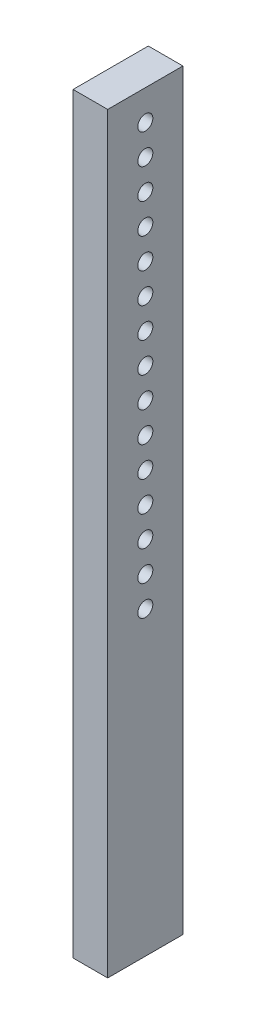
ISO-10303-21;
HEADER;
FILE_DESCRIPTION(('STEP AP214'),'2;1');
FILE_NAME('part.step','',(''),(''),'','','');
FILE_SCHEMA(('AUTOMOTIVE_DESIGN { 1 0 10303 214 1 1 1 1 }'));
ENDSEC;
DATA;
#1=APPLICATION_CONTEXT('core data for automotive mechanical design processes');
#2=APPLICATION_PROTOCOL_DEFINITION('international standard','automotive_design',2000,#1);
#3=PRODUCT_CONTEXT('',#1,'mechanical');
#4=PRODUCT('Part','Part','',(#3));
#5=PRODUCT_RELATED_PRODUCT_CATEGORY('part','',(#4));
#6=PRODUCT_DEFINITION_FORMATION('','',#4);
#7=PRODUCT_DEFINITION_CONTEXT('part definition',#1,'design');
#8=PRODUCT_DEFINITION('design','',#6,#7);
#9=PRODUCT_DEFINITION_SHAPE('','',#8);
#10=(LENGTH_UNIT() NAMED_UNIT(*) SI_UNIT(.MILLI.,.METRE.));
#11=(NAMED_UNIT(*) PLANE_ANGLE_UNIT() SI_UNIT($,.RADIAN.));
#12=(NAMED_UNIT(*) SI_UNIT($,.STERADIAN.) SOLID_ANGLE_UNIT());
#13=UNCERTAINTY_MEASURE_WITH_UNIT(LENGTH_MEASURE(1.E-05),#10,'distance_accuracy_value','');
#14=(GEOMETRIC_REPRESENTATION_CONTEXT(3) GLOBAL_UNCERTAINTY_ASSIGNED_CONTEXT((#13)) GLOBAL_UNIT_ASSIGNED_CONTEXT((#10,
#11,#12)) REPRESENTATION_CONTEXT('',''));
#15=CARTESIAN_POINT('',(0.,0.,0.));
#16=DIRECTION('',(0.,0.,1.));
#17=DIRECTION('',(1.,0.,0.));
#18=AXIS2_PLACEMENT_3D('',#15,#16,#17);
#19=CARTESIAN_POINT('',(23.,0.,0.));
#20=DIRECTION('',(1.,0.,0.));
#21=DIRECTION('',(0.,0.,-1.));
#22=AXIS2_PLACEMENT_3D('',#19,#20,#21);
#23=PLANE('',#22);
#24=CARTESIAN_POINT('',(23.,-30.,-3.42307350556765E-12));
#25=DIRECTION('',(1.,0.,0.));
#26=DIRECTION('',(0.,0.,-1.));
#27=AXIS2_PLACEMENT_3D('',#24,#25,#26);
#28=CIRCLE('',#27,5.);
#29=CARTESIAN_POINT('',(23.,-30.,-5.00000000000342));
#30=VERTEX_POINT('',#29);
#31=EDGE_CURVE('E186',#30,#30,#28,.T.);
#32=ORIENTED_EDGE('',*,*,#31,.F.);
#33=EDGE_LOOP('',(#32));
#34=FACE_BOUND('',#33,.T.);
#35=CARTESIAN_POINT('',(23.,9.99999999999998,-2.89751433454246E-12));
#36=DIRECTION('',(1.,0.,0.));
#37=DIRECTION('',(0.,0.,-1.));
#38=AXIS2_PLACEMENT_3D('',#35,#36,#37);
#39=CIRCLE('',#38,5.);
#40=CARTESIAN_POINT('',(23.,9.99999999999998,-5.0000000000029));
#41=VERTEX_POINT('',#40);
#42=EDGE_CURVE('E174',#41,#41,#39,.T.);
#43=ORIENTED_EDGE('',*,*,#42,.F.);
#44=EDGE_LOOP('',(#43));
#45=FACE_BOUND('',#44,.T.);
#46=CARTESIAN_POINT('',(23.,50.,-2.37195516351727E-12));
#47=DIRECTION('',(1.,0.,0.));
#48=DIRECTION('',(0.,0.,-1.));
#49=AXIS2_PLACEMENT_3D('',#46,#47,#48);
#50=CIRCLE('',#49,5.);
#51=CARTESIAN_POINT('',(23.,50.,-5.00000000000237));
#52=VERTEX_POINT('',#51);
#53=EDGE_CURVE('E162',#52,#52,#50,.T.);
#54=ORIENTED_EDGE('',*,*,#53,.F.);
#55=EDGE_LOOP('',(#54));
#56=FACE_BOUND('',#55,.T.);
#57=CARTESIAN_POINT('',(23.,90.,-1.84639599249208E-12));
#58=DIRECTION('',(1.,0.,0.));
#59=DIRECTION('',(0.,0.,-1.));
#60=AXIS2_PLACEMENT_3D('',#57,#58,#59);
#61=CIRCLE('',#60,5.);
#62=CARTESIAN_POINT('',(23.,90.,-5.00000000000185));
#63=VERTEX_POINT('',#62);
#64=EDGE_CURVE('E150',#63,#63,#61,.T.);
#65=ORIENTED_EDGE('',*,*,#64,.F.);
#66=EDGE_LOOP('',(#65));
#67=FACE_BOUND('',#66,.T.);
#68=CARTESIAN_POINT('',(23.,130.,-1.32083682146688E-12));
#69=DIRECTION('',(1.,0.,0.));
#70=DIRECTION('',(0.,0.,-1.));
#71=AXIS2_PLACEMENT_3D('',#68,#69,#70);
#72=CIRCLE('',#71,5.);
#73=CARTESIAN_POINT('',(23.,130.,-5.00000000000132));
#74=VERTEX_POINT('',#73);
#75=EDGE_CURVE('E138',#74,#74,#72,.T.);
#76=ORIENTED_EDGE('',*,*,#75,.F.);
#77=EDGE_LOOP('',(#76));
#78=FACE_BOUND('',#77,.T.);
#79=CARTESIAN_POINT('',(23.,170.,-7.95277650441694E-13));
#80=DIRECTION('',(1.,0.,0.));
#81=DIRECTION('',(0.,0.,-1.));
#82=AXIS2_PLACEMENT_3D('',#79,#80,#81);
#83=CIRCLE('',#82,5.);
#84=CARTESIAN_POINT('',(23.,170.,-5.0000000000008));
#85=VERTEX_POINT('',#84);
#86=EDGE_CURVE('E126',#85,#85,#83,.T.);
#87=ORIENTED_EDGE('',*,*,#86,.F.);
#88=EDGE_LOOP('',(#87));
#89=FACE_BOUND('',#88,.T.);
#90=CARTESIAN_POINT('',(23.,210.,-2.69718479416503E-13));
#91=DIRECTION('',(1.,0.,0.));
#92=DIRECTION('',(0.,0.,-1.));
#93=AXIS2_PLACEMENT_3D('',#90,#91,#92);
#94=CIRCLE('',#93,5.);
#95=CARTESIAN_POINT('',(23.,210.,-5.00000000000027));
#96=VERTEX_POINT('',#95);
#97=EDGE_CURVE('E114',#96,#96,#94,.T.);
#98=ORIENTED_EDGE('',*,*,#97,.F.);
#99=EDGE_LOOP('',(#98));
#100=FACE_BOUND('',#99,.T.);
#101=DIRECTION('',(0.,1.,0.));
#102=VECTOR('',#101,1.);
#103=CARTESIAN_POINT('',(23.,250.,-25.));
#104=LINE('',#103,#102);
#105=CARTESIAN_POINT('',(23.,-250.,-25.));
#106=VERTEX_POINT('',#105);
#107=CARTESIAN_POINT('',(23.,250.,-25.));
#108=VERTEX_POINT('',#107);
#109=EDGE_CURVE('E84',#106,#108,#104,.T.);
#110=ORIENTED_EDGE('',*,*,#109,.T.);
#111=DIRECTION('',(0.,0.,1.));
#112=VECTOR('',#111,1.);
#113=CARTESIAN_POINT('',(23.,250.,25.));
#114=LINE('',#113,#112);
#115=CARTESIAN_POINT('',(23.,250.,25.));
#116=VERTEX_POINT('',#115);
#117=EDGE_CURVE('E79',#108,#116,#114,.T.);
#118=ORIENTED_EDGE('',*,*,#117,.T.);
#119=DIRECTION('',(0.,-1.,0.));
#120=VECTOR('',#119,1.);
#121=CARTESIAN_POINT('',(23.,250.,25.));
#122=LINE('',#121,#120);
#123=CARTESIAN_POINT('',(23.,-250.,25.));
#124=VERTEX_POINT('',#123);
#125=EDGE_CURVE('E82',#116,#124,#122,.T.);
#126=ORIENTED_EDGE('',*,*,#125,.T.);
#127=DIRECTION('',(0.,0.,-1.));
#128=VECTOR('',#127,1.);
#129=CARTESIAN_POINT('',(23.,-250.,25.));
#130=LINE('',#129,#128);
#131=EDGE_CURVE('E49',#124,#106,#130,.T.);
#132=ORIENTED_EDGE('',*,*,#131,.T.);
#133=EDGE_LOOP('',(#110,#118,#126,#132));
#134=FACE_BOUND('',#133,.T.);
#135=CARTESIAN_POINT('',(23.,230.,0.));
#136=DIRECTION('',(1.,0.,0.));
#137=DIRECTION('',(0.,0.,-1.));
#138=AXIS2_PLACEMENT_3D('',#135,#136,#137);
#139=CIRCLE('',#138,5.);
#140=CARTESIAN_POINT('',(23.,230.,-5.00000000000001));
#141=VERTEX_POINT('',#140);
#142=EDGE_CURVE('E99',#141,#141,#139,.T.);
#143=ORIENTED_EDGE('',*,*,#142,.F.);
#144=EDGE_LOOP('',(#143));
#145=FACE_BOUND('',#144,.T.);
#146=CARTESIAN_POINT('',(23.,190.,-5.32498064929098E-13));
#147=DIRECTION('',(1.,0.,0.));
#148=DIRECTION('',(0.,0.,-1.));
#149=AXIS2_PLACEMENT_3D('',#146,#147,#148);
#150=CIRCLE('',#149,5.);
#151=CARTESIAN_POINT('',(23.,190.,-5.00000000000053));
#152=VERTEX_POINT('',#151);
#153=EDGE_CURVE('E120',#152,#152,#150,.T.);
#154=ORIENTED_EDGE('',*,*,#153,.F.);
#155=EDGE_LOOP('',(#154));
#156=FACE_BOUND('',#155,.T.);
#157=CARTESIAN_POINT('',(23.,150.,-1.05805723595429E-12));
#158=DIRECTION('',(1.,0.,0.));
#159=DIRECTION('',(0.,0.,-1.));
#160=AXIS2_PLACEMENT_3D('',#157,#158,#159);
#161=CIRCLE('',#160,5.);
#162=CARTESIAN_POINT('',(23.,150.,-5.00000000000106));
#163=VERTEX_POINT('',#162);
#164=EDGE_CURVE('E132',#163,#163,#161,.T.);
#165=ORIENTED_EDGE('',*,*,#164,.F.);
#166=EDGE_LOOP('',(#165));
#167=FACE_BOUND('',#166,.T.);
#168=CARTESIAN_POINT('',(23.,110.,-1.58361640697948E-12));
#169=DIRECTION('',(1.,0.,0.));
#170=DIRECTION('',(0.,0.,-1.));
#171=AXIS2_PLACEMENT_3D('',#168,#169,#170);
#172=CIRCLE('',#171,5.);
#173=CARTESIAN_POINT('',(23.,110.,-5.00000000000159));
#174=VERTEX_POINT('',#173);
#175=EDGE_CURVE('E144',#174,#174,#172,.T.);
#176=ORIENTED_EDGE('',*,*,#175,.F.);
#177=EDGE_LOOP('',(#176));
#178=FACE_BOUND('',#177,.T.);
#179=CARTESIAN_POINT('',(23.,70.,-2.10917557800467E-12));
#180=DIRECTION('',(1.,0.,0.));
#181=DIRECTION('',(0.,0.,-1.));
#182=AXIS2_PLACEMENT_3D('',#179,#180,#181);
#183=CIRCLE('',#182,5.);
#184=CARTESIAN_POINT('',(23.,70.,-5.00000000000211));
#185=VERTEX_POINT('',#184);
#186=EDGE_CURVE('E156',#185,#185,#183,.T.);
#187=ORIENTED_EDGE('',*,*,#186,.F.);
#188=EDGE_LOOP('',(#187));
#189=FACE_BOUND('',#188,.T.);
#190=CARTESIAN_POINT('',(23.,30.,-2.63473474902986E-12));
#191=DIRECTION('',(1.,0.,0.));
#192=DIRECTION('',(0.,0.,-1.));
#193=AXIS2_PLACEMENT_3D('',#190,#191,#192);
#194=CIRCLE('',#193,5.);
#195=CARTESIAN_POINT('',(23.,30.,-5.00000000000264));
#196=VERTEX_POINT('',#195);
#197=EDGE_CURVE('E168',#196,#196,#194,.T.);
#198=ORIENTED_EDGE('',*,*,#197,.F.);
#199=EDGE_LOOP('',(#198));
#200=FACE_BOUND('',#199,.T.);
#201=CARTESIAN_POINT('',(23.,-10.,-3.16029392005505E-12));
#202=DIRECTION('',(1.,0.,0.));
#203=DIRECTION('',(0.,0.,-1.));
#204=AXIS2_PLACEMENT_3D('',#201,#202,#203);
#205=CIRCLE('',#204,5.);
#206=CARTESIAN_POINT('',(23.,-10.,-5.00000000000316));
#207=VERTEX_POINT('',#206);
#208=EDGE_CURVE('E180',#207,#207,#205,.T.);
#209=ORIENTED_EDGE('',*,*,#208,.F.);
#210=EDGE_LOOP('',(#209));
#211=FACE_BOUND('',#210,.T.);
#212=CARTESIAN_POINT('',(23.,-50.,-3.68585309108025E-12));
#213=DIRECTION('',(1.,0.,0.));
#214=DIRECTION('',(0.,0.,-1.));
#215=AXIS2_PLACEMENT_3D('',#212,#213,#214);
#216=CIRCLE('',#215,5.);
#217=CARTESIAN_POINT('',(23.,-50.,-5.00000000000369));
#218=VERTEX_POINT('',#217);
#219=EDGE_CURVE('E192',#218,#218,#216,.T.);
#220=ORIENTED_EDGE('',*,*,#219,.F.);
#221=EDGE_LOOP('',(#220));
#222=FACE_BOUND('',#221,.T.);
#223=ADVANCED_FACE('F32',(#34,#45,#56,#67,#78,#89,#100,#134,#145,#156,#167,#178,#189,#200,#211,
#222),#23,.T.);
#224=CARTESIAN_POINT('',(0.,0.,0.));
#225=DIRECTION('',(1.,0.,0.));
#226=DIRECTION('',(0.,0.,-1.));
#227=AXIS2_PLACEMENT_3D('',#224,#225,#226);
#228=PLANE('',#227);
#229=CARTESIAN_POINT('',(0.,-30.,-3.42307350556765E-12));
#230=DIRECTION('',(1.,0.,0.));
#231=DIRECTION('',(0.,0.,-1.));
#232=AXIS2_PLACEMENT_3D('',#229,#230,#231);
#233=CIRCLE('',#232,5.);
#234=CARTESIAN_POINT('',(0.,-30.,-5.00000000000342));
#235=VERTEX_POINT('',#234);
#236=EDGE_CURVE('E189',#235,#235,#233,.T.);
#237=ORIENTED_EDGE('',*,*,#236,.T.);
#238=EDGE_LOOP('',(#237));
#239=FACE_BOUND('',#238,.T.);
#240=CARTESIAN_POINT('',(0.,9.99999999999998,-2.89751433454246E-12));
#241=DIRECTION('',(1.,0.,0.));
#242=DIRECTION('',(0.,0.,-1.));
#243=AXIS2_PLACEMENT_3D('',#240,#241,#242);
#244=CIRCLE('',#243,5.);
#245=CARTESIAN_POINT('',(0.,9.99999999999998,-5.0000000000029));
#246=VERTEX_POINT('',#245);
#247=EDGE_CURVE('E177',#246,#246,#244,.T.);
#248=ORIENTED_EDGE('',*,*,#247,.T.);
#249=EDGE_LOOP('',(#248));
#250=FACE_BOUND('',#249,.T.);
#251=CARTESIAN_POINT('',(0.,50.,-2.37195516351727E-12));
#252=DIRECTION('',(1.,0.,0.));
#253=DIRECTION('',(0.,0.,-1.));
#254=AXIS2_PLACEMENT_3D('',#251,#252,#253);
#255=CIRCLE('',#254,5.);
#256=CARTESIAN_POINT('',(0.,50.,-5.00000000000237));
#257=VERTEX_POINT('',#256);
#258=EDGE_CURVE('E165',#257,#257,#255,.T.);
#259=ORIENTED_EDGE('',*,*,#258,.T.);
#260=EDGE_LOOP('',(#259));
#261=FACE_BOUND('',#260,.T.);
#262=CARTESIAN_POINT('',(0.,90.,-1.84639599249208E-12));
#263=DIRECTION('',(1.,0.,0.));
#264=DIRECTION('',(0.,0.,-1.));
#265=AXIS2_PLACEMENT_3D('',#262,#263,#264);
#266=CIRCLE('',#265,5.);
#267=CARTESIAN_POINT('',(0.,90.,-5.00000000000185));
#268=VERTEX_POINT('',#267);
#269=EDGE_CURVE('E153',#268,#268,#266,.T.);
#270=ORIENTED_EDGE('',*,*,#269,.T.);
#271=EDGE_LOOP('',(#270));
#272=FACE_BOUND('',#271,.T.);
#273=CARTESIAN_POINT('',(0.,130.,-1.32083682146688E-12));
#274=DIRECTION('',(1.,0.,0.));
#275=DIRECTION('',(0.,0.,-1.));
#276=AXIS2_PLACEMENT_3D('',#273,#274,#275);
#277=CIRCLE('',#276,5.);
#278=CARTESIAN_POINT('',(0.,130.,-5.00000000000132));
#279=VERTEX_POINT('',#278);
#280=EDGE_CURVE('E141',#279,#279,#277,.T.);
#281=ORIENTED_EDGE('',*,*,#280,.T.);
#282=EDGE_LOOP('',(#281));
#283=FACE_BOUND('',#282,.T.);
#284=CARTESIAN_POINT('',(0.,170.,-7.95277650441694E-13));
#285=DIRECTION('',(1.,0.,0.));
#286=DIRECTION('',(0.,0.,-1.));
#287=AXIS2_PLACEMENT_3D('',#284,#285,#286);
#288=CIRCLE('',#287,5.);
#289=CARTESIAN_POINT('',(0.,170.,-5.0000000000008));
#290=VERTEX_POINT('',#289);
#291=EDGE_CURVE('E129',#290,#290,#288,.T.);
#292=ORIENTED_EDGE('',*,*,#291,.T.);
#293=EDGE_LOOP('',(#292));
#294=FACE_BOUND('',#293,.T.);
#295=CARTESIAN_POINT('',(0.,210.,-2.69718479416503E-13));
#296=DIRECTION('',(1.,0.,0.));
#297=DIRECTION('',(0.,0.,-1.));
#298=AXIS2_PLACEMENT_3D('',#295,#296,#297);
#299=CIRCLE('',#298,5.);
#300=CARTESIAN_POINT('',(0.,210.,-5.00000000000027));
#301=VERTEX_POINT('',#300);
#302=EDGE_CURVE('E117',#301,#301,#299,.T.);
#303=ORIENTED_EDGE('',*,*,#302,.T.);
#304=EDGE_LOOP('',(#303));
#305=FACE_BOUND('',#304,.T.);
#306=DIRECTION('',(0.,1.,0.));
#307=VECTOR('',#306,1.);
#308=CARTESIAN_POINT('',(0.,250.,-25.));
#309=LINE('',#308,#307);
#310=CARTESIAN_POINT('',(0.,-250.,-25.));
#311=VERTEX_POINT('',#310);
#312=CARTESIAN_POINT('',(0.,250.,-25.));
#313=VERTEX_POINT('',#312);
#314=EDGE_CURVE('E96',#311,#313,#309,.T.);
#315=ORIENTED_EDGE('',*,*,#314,.F.);
#316=DIRECTION('',(0.,0.,-1.));
#317=VECTOR('',#316,1.);
#318=CARTESIAN_POINT('',(0.,-250.,25.));
#319=LINE('',#318,#317);
#320=CARTESIAN_POINT('',(0.,-250.,25.));
#321=VERTEX_POINT('',#320);
#322=EDGE_CURVE('E72',#321,#311,#319,.T.);
#323=ORIENTED_EDGE('',*,*,#322,.F.);
#324=DIRECTION('',(0.,-1.,0.));
#325=VECTOR('',#324,1.);
#326=CARTESIAN_POINT('',(0.,250.,25.));
#327=LINE('',#326,#325);
#328=CARTESIAN_POINT('',(0.,250.,25.));
#329=VERTEX_POINT('',#328);
#330=EDGE_CURVE('E66',#329,#321,#327,.T.);
#331=ORIENTED_EDGE('',*,*,#330,.F.);
#332=DIRECTION('',(0.,0.,1.));
#333=VECTOR('',#332,1.);
#334=CARTESIAN_POINT('',(0.,250.,25.));
#335=LINE('',#334,#333);
#336=EDGE_CURVE('E88',#313,#329,#335,.T.);
#337=ORIENTED_EDGE('',*,*,#336,.F.);
#338=EDGE_LOOP('',(#315,#323,#331,#337));
#339=FACE_BOUND('',#338,.T.);
#340=CARTESIAN_POINT('',(0.,230.,0.));
#341=DIRECTION('',(1.,0.,0.));
#342=DIRECTION('',(0.,0.,-1.));
#343=AXIS2_PLACEMENT_3D('',#340,#341,#342);
#344=CIRCLE('',#343,5.);
#345=CARTESIAN_POINT('',(0.,230.,-5.00000000000001));
#346=VERTEX_POINT('',#345);
#347=EDGE_CURVE('E111',#346,#346,#344,.T.);
#348=ORIENTED_EDGE('',*,*,#347,.T.);
#349=EDGE_LOOP('',(#348));
#350=FACE_BOUND('',#349,.T.);
#351=CARTESIAN_POINT('',(0.,190.,-5.32498064929098E-13));
#352=DIRECTION('',(1.,0.,0.));
#353=DIRECTION('',(0.,0.,-1.));
#354=AXIS2_PLACEMENT_3D('',#351,#352,#353);
#355=CIRCLE('',#354,5.);
#356=CARTESIAN_POINT('',(0.,190.,-5.00000000000053));
#357=VERTEX_POINT('',#356);
#358=EDGE_CURVE('E123',#357,#357,#355,.T.);
#359=ORIENTED_EDGE('',*,*,#358,.T.);
#360=EDGE_LOOP('',(#359));
#361=FACE_BOUND('',#360,.T.);
#362=CARTESIAN_POINT('',(0.,150.,-1.05805723595429E-12));
#363=DIRECTION('',(1.,0.,0.));
#364=DIRECTION('',(0.,0.,-1.));
#365=AXIS2_PLACEMENT_3D('',#362,#363,#364);
#366=CIRCLE('',#365,5.);
#367=CARTESIAN_POINT('',(0.,150.,-5.00000000000106));
#368=VERTEX_POINT('',#367);
#369=EDGE_CURVE('E135',#368,#368,#366,.T.);
#370=ORIENTED_EDGE('',*,*,#369,.T.);
#371=EDGE_LOOP('',(#370));
#372=FACE_BOUND('',#371,.T.);
#373=CARTESIAN_POINT('',(0.,110.,-1.58361640697948E-12));
#374=DIRECTION('',(1.,0.,0.));
#375=DIRECTION('',(0.,0.,-1.));
#376=AXIS2_PLACEMENT_3D('',#373,#374,#375);
#377=CIRCLE('',#376,5.);
#378=CARTESIAN_POINT('',(0.,110.,-5.00000000000159));
#379=VERTEX_POINT('',#378);
#380=EDGE_CURVE('E147',#379,#379,#377,.T.);
#381=ORIENTED_EDGE('',*,*,#380,.T.);
#382=EDGE_LOOP('',(#381));
#383=FACE_BOUND('',#382,.T.);
#384=CARTESIAN_POINT('',(0.,70.,-2.10917557800467E-12));
#385=DIRECTION('',(1.,0.,0.));
#386=DIRECTION('',(0.,0.,-1.));
#387=AXIS2_PLACEMENT_3D('',#384,#385,#386);
#388=CIRCLE('',#387,5.);
#389=CARTESIAN_POINT('',(0.,70.,-5.00000000000211));
#390=VERTEX_POINT('',#389);
#391=EDGE_CURVE('E159',#390,#390,#388,.T.);
#392=ORIENTED_EDGE('',*,*,#391,.T.);
#393=EDGE_LOOP('',(#392));
#394=FACE_BOUND('',#393,.T.);
#395=CARTESIAN_POINT('',(0.,30.,-2.63473474902986E-12));
#396=DIRECTION('',(1.,0.,0.));
#397=DIRECTION('',(0.,0.,-1.));
#398=AXIS2_PLACEMENT_3D('',#395,#396,#397);
#399=CIRCLE('',#398,5.);
#400=CARTESIAN_POINT('',(0.,30.,-5.00000000000264));
#401=VERTEX_POINT('',#400);
#402=EDGE_CURVE('E171',#401,#401,#399,.T.);
#403=ORIENTED_EDGE('',*,*,#402,.T.);
#404=EDGE_LOOP('',(#403));
#405=FACE_BOUND('',#404,.T.);
#406=CARTESIAN_POINT('',(0.,-10.,-3.16029392005505E-12));
#407=DIRECTION('',(1.,0.,0.));
#408=DIRECTION('',(0.,0.,-1.));
#409=AXIS2_PLACEMENT_3D('',#406,#407,#408);
#410=CIRCLE('',#409,5.);
#411=CARTESIAN_POINT('',(0.,-10.,-5.00000000000316));
#412=VERTEX_POINT('',#411);
#413=EDGE_CURVE('E183',#412,#412,#410,.T.);
#414=ORIENTED_EDGE('',*,*,#413,.T.);
#415=EDGE_LOOP('',(#414));
#416=FACE_BOUND('',#415,.T.);
#417=CARTESIAN_POINT('',(0.,-50.,-3.68585309108025E-12));
#418=DIRECTION('',(1.,0.,0.));
#419=DIRECTION('',(0.,0.,-1.));
#420=AXIS2_PLACEMENT_3D('',#417,#418,#419);
#421=CIRCLE('',#420,5.);
#422=CARTESIAN_POINT('',(0.,-50.,-5.00000000000369));
#423=VERTEX_POINT('',#422);
#424=EDGE_CURVE('E195',#423,#423,#421,.T.);
#425=ORIENTED_EDGE('',*,*,#424,.T.);
#426=EDGE_LOOP('',(#425));
#427=FACE_BOUND('',#426,.T.);
#428=ADVANCED_FACE('F107',(#239,#250,#261,#272,#283,#294,#305,#339,#350,#361,#372,#383,#394,
#405,#416,#427),#228,.F.);
#429=CARTESIAN_POINT('',(23.,250.,-25.));
#430=DIRECTION('',(0.,0.,1.));
#431=DIRECTION('',(0.,-1.,0.));
#432=AXIS2_PLACEMENT_3D('',#429,#430,#431);
#433=PLANE('',#432);
#434=ORIENTED_EDGE('',*,*,#314,.T.);
#435=DIRECTION('',(-1.,0.,0.));
#436=VECTOR('',#435,1.);
#437=CARTESIAN_POINT('',(23.,250.,-25.));
#438=LINE('',#437,#436);
#439=EDGE_CURVE('E11',#108,#313,#438,.T.);
#440=ORIENTED_EDGE('',*,*,#439,.F.);
#441=ORIENTED_EDGE('',*,*,#109,.F.);
#442=DIRECTION('',(-1.,0.,0.));
#443=VECTOR('',#442,1.);
#444=CARTESIAN_POINT('',(23.,-250.,-25.));
#445=LINE('',#444,#443);
#446=EDGE_CURVE('E92',#106,#311,#445,.T.);
#447=ORIENTED_EDGE('',*,*,#446,.T.);
#448=EDGE_LOOP('',(#434,#440,#441,#447));
#449=FACE_BOUND('',#448,.T.);
#450=ADVANCED_FACE('F34',(#449),#433,.F.);
#451=CARTESIAN_POINT('',(23.,250.,25.));
#452=DIRECTION('',(0.,-1.,0.));
#453=DIRECTION('',(0.,0.,-1.));
#454=AXIS2_PLACEMENT_3D('',#451,#452,#453);
#455=PLANE('',#454);
#456=ORIENTED_EDGE('',*,*,#336,.T.);
#457=DIRECTION('',(-1.,0.,0.));
#458=VECTOR('',#457,1.);
#459=CARTESIAN_POINT('',(23.,250.,25.));
#460=LINE('',#459,#458);
#461=EDGE_CURVE('E41',#116,#329,#460,.T.);
#462=ORIENTED_EDGE('',*,*,#461,.F.);
#463=ORIENTED_EDGE('',*,*,#117,.F.);
#464=ORIENTED_EDGE('',*,*,#439,.T.);
#465=EDGE_LOOP('',(#456,#462,#463,#464));
#466=FACE_BOUND('',#465,.T.);
#467=ADVANCED_FACE('F87',(#466),#455,.F.);
#468=CARTESIAN_POINT('',(23.,250.,25.));
#469=DIRECTION('',(0.,0.,-1.));
#470=DIRECTION('',(0.,1.,0.));
#471=AXIS2_PLACEMENT_3D('',#468,#469,#470);
#472=PLANE('',#471);
#473=ORIENTED_EDGE('',*,*,#330,.T.);
#474=DIRECTION('',(-1.,0.,0.));
#475=VECTOR('',#474,1.);
#476=CARTESIAN_POINT('',(23.,-250.,25.));
#477=LINE('',#476,#475);
#478=EDGE_CURVE('E89',#124,#321,#477,.T.);
#479=ORIENTED_EDGE('',*,*,#478,.F.);
#480=ORIENTED_EDGE('',*,*,#125,.F.);
#481=ORIENTED_EDGE('',*,*,#461,.T.);
#482=EDGE_LOOP('',(#473,#479,#480,#481));
#483=FACE_BOUND('',#482,.T.);
#484=ADVANCED_FACE('F90',(#483),#472,.F.);
#485=CARTESIAN_POINT('',(23.,-250.,25.));
#486=DIRECTION('',(0.,1.,0.));
#487=DIRECTION('',(0.,0.,1.));
#488=AXIS2_PLACEMENT_3D('',#485,#486,#487);
#489=PLANE('',#488);
#490=ORIENTED_EDGE('',*,*,#322,.T.);
#491=ORIENTED_EDGE('',*,*,#446,.F.);
#492=ORIENTED_EDGE('',*,*,#131,.F.);
#493=ORIENTED_EDGE('',*,*,#478,.T.);
#494=EDGE_LOOP('',(#490,#491,#492,#493));
#495=FACE_BOUND('',#494,.T.);
#496=ADVANCED_FACE('F104',(#495),#489,.F.);
#497=CARTESIAN_POINT('',(23.,230.,0.));
#498=DIRECTION('',(-1.,0.,0.));
#499=DIRECTION('',(0.,0.,1.));
#500=AXIS2_PLACEMENT_3D('',#497,#498,#499);
#501=CYLINDRICAL_SURFACE('',#500,5.);
#502=ORIENTED_EDGE('',*,*,#142,.T.);
#503=EDGE_LOOP('',(#502));
#504=FACE_BOUND('',#503,.T.);
#505=ORIENTED_EDGE('',*,*,#347,.F.);
#506=EDGE_LOOP('',(#505));
#507=FACE_BOUND('',#506,.T.);
#508=ADVANCED_FACE('F215',(#504,#507),#501,.F.);
#509=CARTESIAN_POINT('',(23.,210.,-2.69718479416503E-13));
#510=DIRECTION('',(-1.,0.,0.));
#511=DIRECTION('',(0.,0.,1.));
#512=AXIS2_PLACEMENT_3D('',#509,#510,#511);
#513=CYLINDRICAL_SURFACE('',#512,5.);
#514=ORIENTED_EDGE('',*,*,#97,.T.);
#515=EDGE_LOOP('',(#514));
#516=FACE_BOUND('',#515,.T.);
#517=ORIENTED_EDGE('',*,*,#302,.F.);
#518=EDGE_LOOP('',(#517));
#519=FACE_BOUND('',#518,.T.);
#520=ADVANCED_FACE('F261',(#516,#519),#513,.F.);
#521=CARTESIAN_POINT('',(23.,190.,-5.32498064929098E-13));
#522=DIRECTION('',(-1.,0.,0.));
#523=DIRECTION('',(0.,0.,1.));
#524=AXIS2_PLACEMENT_3D('',#521,#522,#523);
#525=CYLINDRICAL_SURFACE('',#524,5.);
#526=ORIENTED_EDGE('',*,*,#153,.T.);
#527=EDGE_LOOP('',(#526));
#528=FACE_BOUND('',#527,.T.);
#529=ORIENTED_EDGE('',*,*,#358,.F.);
#530=EDGE_LOOP('',(#529));
#531=FACE_BOUND('',#530,.T.);
#532=ADVANCED_FACE('F269',(#528,#531),#525,.F.);
#533=CARTESIAN_POINT('',(23.,170.,-7.95277650441694E-13));
#534=DIRECTION('',(-1.,0.,0.));
#535=DIRECTION('',(0.,0.,1.));
#536=AXIS2_PLACEMENT_3D('',#533,#534,#535);
#537=CYLINDRICAL_SURFACE('',#536,5.);
#538=ORIENTED_EDGE('',*,*,#86,.T.);
#539=EDGE_LOOP('',(#538));
#540=FACE_BOUND('',#539,.T.);
#541=ORIENTED_EDGE('',*,*,#291,.F.);
#542=EDGE_LOOP('',(#541));
#543=FACE_BOUND('',#542,.T.);
#544=ADVANCED_FACE('F277',(#540,#543),#537,.F.);
#545=CARTESIAN_POINT('',(23.,150.,-1.05805723595429E-12));
#546=DIRECTION('',(-1.,0.,0.));
#547=DIRECTION('',(0.,0.,1.));
#548=AXIS2_PLACEMENT_3D('',#545,#546,#547);
#549=CYLINDRICAL_SURFACE('',#548,5.);
#550=ORIENTED_EDGE('',*,*,#164,.T.);
#551=EDGE_LOOP('',(#550));
#552=FACE_BOUND('',#551,.T.);
#553=ORIENTED_EDGE('',*,*,#369,.F.);
#554=EDGE_LOOP('',(#553));
#555=FACE_BOUND('',#554,.T.);
#556=ADVANCED_FACE('F286',(#552,#555),#549,.F.);
#557=CARTESIAN_POINT('',(23.,130.,-1.32083682146688E-12));
#558=DIRECTION('',(-1.,0.,0.));
#559=DIRECTION('',(0.,0.,1.));
#560=AXIS2_PLACEMENT_3D('',#557,#558,#559);
#561=CYLINDRICAL_SURFACE('',#560,5.);
#562=ORIENTED_EDGE('',*,*,#75,.T.);
#563=EDGE_LOOP('',(#562));
#564=FACE_BOUND('',#563,.T.);
#565=ORIENTED_EDGE('',*,*,#280,.F.);
#566=EDGE_LOOP('',(#565));
#567=FACE_BOUND('',#566,.T.);
#568=ADVANCED_FACE('F295',(#564,#567),#561,.F.);
#569=CARTESIAN_POINT('',(23.,110.,-1.58361640697948E-12));
#570=DIRECTION('',(-1.,0.,0.));
#571=DIRECTION('',(0.,0.,1.));
#572=AXIS2_PLACEMENT_3D('',#569,#570,#571);
#573=CYLINDRICAL_SURFACE('',#572,5.);
#574=ORIENTED_EDGE('',*,*,#175,.T.);
#575=EDGE_LOOP('',(#574));
#576=FACE_BOUND('',#575,.T.);
#577=ORIENTED_EDGE('',*,*,#380,.F.);
#578=EDGE_LOOP('',(#577));
#579=FACE_BOUND('',#578,.T.);
#580=ADVANCED_FACE('F304',(#576,#579),#573,.F.);
#581=CARTESIAN_POINT('',(23.,90.,-1.84639599249208E-12));
#582=DIRECTION('',(-1.,0.,0.));
#583=DIRECTION('',(0.,0.,1.));
#584=AXIS2_PLACEMENT_3D('',#581,#582,#583);
#585=CYLINDRICAL_SURFACE('',#584,5.);
#586=ORIENTED_EDGE('',*,*,#64,.T.);
#587=EDGE_LOOP('',(#586));
#588=FACE_BOUND('',#587,.T.);
#589=ORIENTED_EDGE('',*,*,#269,.F.);
#590=EDGE_LOOP('',(#589));
#591=FACE_BOUND('',#590,.T.);
#592=ADVANCED_FACE('F313',(#588,#591),#585,.F.);
#593=CARTESIAN_POINT('',(23.,70.,-2.10917557800467E-12));
#594=DIRECTION('',(-1.,0.,0.));
#595=DIRECTION('',(0.,0.,1.));
#596=AXIS2_PLACEMENT_3D('',#593,#594,#595);
#597=CYLINDRICAL_SURFACE('',#596,5.);
#598=ORIENTED_EDGE('',*,*,#186,.T.);
#599=EDGE_LOOP('',(#598));
#600=FACE_BOUND('',#599,.T.);
#601=ORIENTED_EDGE('',*,*,#391,.F.);
#602=EDGE_LOOP('',(#601));
#603=FACE_BOUND('',#602,.T.);
#604=ADVANCED_FACE('F322',(#600,#603),#597,.F.);
#605=CARTESIAN_POINT('',(23.,50.,-2.37195516351727E-12));
#606=DIRECTION('',(-1.,0.,0.));
#607=DIRECTION('',(0.,0.,1.));
#608=AXIS2_PLACEMENT_3D('',#605,#606,#607);
#609=CYLINDRICAL_SURFACE('',#608,5.);
#610=ORIENTED_EDGE('',*,*,#53,.T.);
#611=EDGE_LOOP('',(#610));
#612=FACE_BOUND('',#611,.T.);
#613=ORIENTED_EDGE('',*,*,#258,.F.);
#614=EDGE_LOOP('',(#613));
#615=FACE_BOUND('',#614,.T.);
#616=ADVANCED_FACE('F331',(#612,#615),#609,.F.);
#617=CARTESIAN_POINT('',(23.,30.,-2.63473474902986E-12));
#618=DIRECTION('',(-1.,0.,0.));
#619=DIRECTION('',(0.,0.,1.));
#620=AXIS2_PLACEMENT_3D('',#617,#618,#619);
#621=CYLINDRICAL_SURFACE('',#620,5.);
#622=ORIENTED_EDGE('',*,*,#197,.T.);
#623=EDGE_LOOP('',(#622));
#624=FACE_BOUND('',#623,.T.);
#625=ORIENTED_EDGE('',*,*,#402,.F.);
#626=EDGE_LOOP('',(#625));
#627=FACE_BOUND('',#626,.T.);
#628=ADVANCED_FACE('F340',(#624,#627),#621,.F.);
#629=CARTESIAN_POINT('',(23.,9.99999999999998,-2.89751433454246E-12));
#630=DIRECTION('',(-1.,0.,0.));
#631=DIRECTION('',(0.,0.,1.));
#632=AXIS2_PLACEMENT_3D('',#629,#630,#631);
#633=CYLINDRICAL_SURFACE('',#632,5.);
#634=ORIENTED_EDGE('',*,*,#42,.T.);
#635=EDGE_LOOP('',(#634));
#636=FACE_BOUND('',#635,.T.);
#637=ORIENTED_EDGE('',*,*,#247,.F.);
#638=EDGE_LOOP('',(#637));
#639=FACE_BOUND('',#638,.T.);
#640=ADVANCED_FACE('F349',(#636,#639),#633,.F.);
#641=CARTESIAN_POINT('',(23.,-10.,-3.16029392005505E-12));
#642=DIRECTION('',(-1.,0.,0.));
#643=DIRECTION('',(0.,0.,1.));
#644=AXIS2_PLACEMENT_3D('',#641,#642,#643);
#645=CYLINDRICAL_SURFACE('',#644,5.);
#646=ORIENTED_EDGE('',*,*,#208,.T.);
#647=EDGE_LOOP('',(#646));
#648=FACE_BOUND('',#647,.T.);
#649=ORIENTED_EDGE('',*,*,#413,.F.);
#650=EDGE_LOOP('',(#649));
#651=FACE_BOUND('',#650,.T.);
#652=ADVANCED_FACE('F358',(#648,#651),#645,.F.);
#653=CARTESIAN_POINT('',(23.,-30.,-3.42307350556765E-12));
#654=DIRECTION('',(-1.,0.,0.));
#655=DIRECTION('',(0.,0.,1.));
#656=AXIS2_PLACEMENT_3D('',#653,#654,#655);
#657=CYLINDRICAL_SURFACE('',#656,5.);
#658=ORIENTED_EDGE('',*,*,#31,.T.);
#659=EDGE_LOOP('',(#658));
#660=FACE_BOUND('',#659,.T.);
#661=ORIENTED_EDGE('',*,*,#236,.F.);
#662=EDGE_LOOP('',(#661));
#663=FACE_BOUND('',#662,.T.);
#664=ADVANCED_FACE('F367',(#660,#663),#657,.F.);
#665=CARTESIAN_POINT('',(23.,-50.,-3.68585309108025E-12));
#666=DIRECTION('',(-1.,0.,0.));
#667=DIRECTION('',(0.,0.,1.));
#668=AXIS2_PLACEMENT_3D('',#665,#666,#667);
#669=CYLINDRICAL_SURFACE('',#668,5.);
#670=ORIENTED_EDGE('',*,*,#219,.T.);
#671=EDGE_LOOP('',(#670));
#672=FACE_BOUND('',#671,.T.);
#673=ORIENTED_EDGE('',*,*,#424,.F.);
#674=EDGE_LOOP('',(#673));
#675=FACE_BOUND('',#674,.T.);
#676=ADVANCED_FACE('F201',(#672,#675),#669,.F.);
#677=CLOSED_SHELL('',(#223,#428,#450,#467,#484,#496,#508,#520,#532,#544,#556,#568,#580,#592,
#604,#616,#628,#640,#652,#664,#676));
#678=MANIFOLD_SOLID_BREP('B2',#677);
#679=ADVANCED_BREP_SHAPE_REPRESENTATION('',(#18,#678),#14);
#680=SHAPE_DEFINITION_REPRESENTATION(#9,#679);
ENDSEC;
END-ISO-10303-21;
